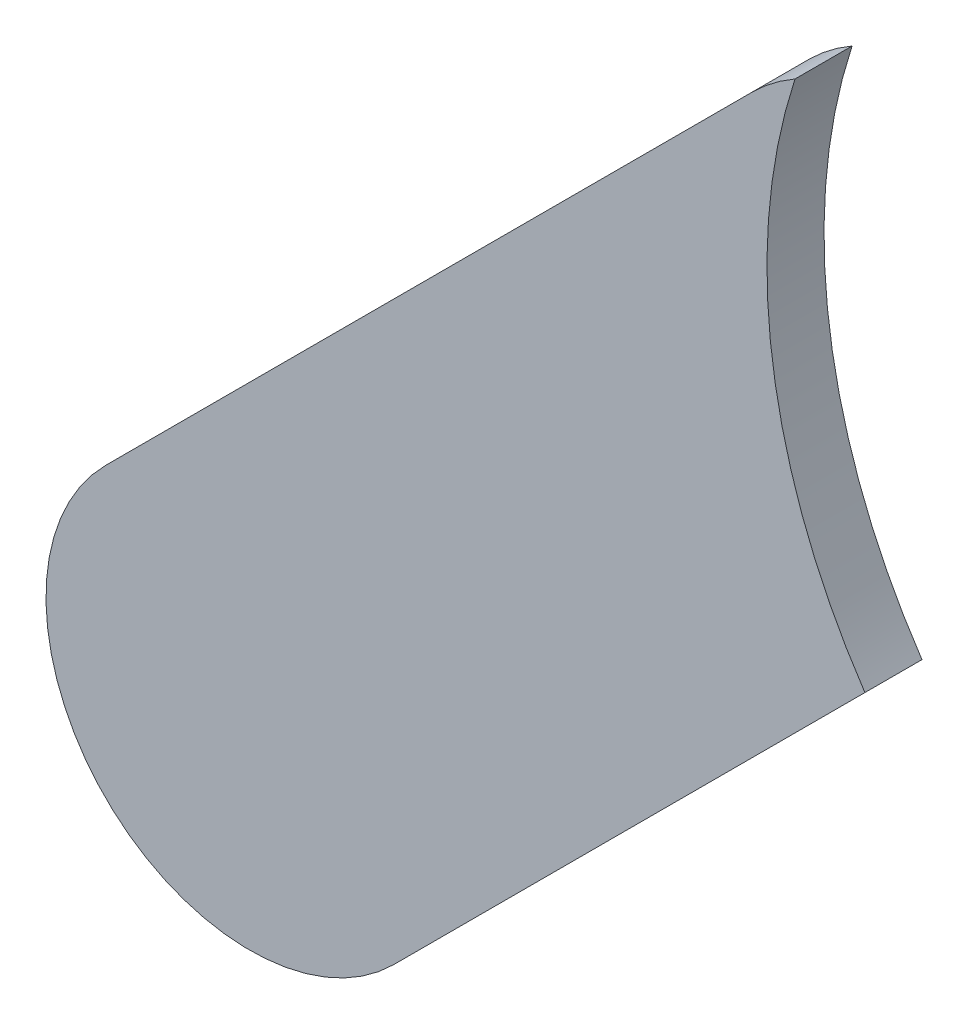
ISO-10303-21;
HEADER;
FILE_DESCRIPTION(('STEP AP214'),'2;1');
FILE_NAME('part.step','',(''),(''),'','','');
FILE_SCHEMA(('AUTOMOTIVE_DESIGN { 1 0 10303 214 1 1 1 1 }'));
ENDSEC;
DATA;
#1=APPLICATION_CONTEXT('core data for automotive mechanical design processes');
#2=APPLICATION_PROTOCOL_DEFINITION('international standard','automotive_design',2000,#1);
#3=PRODUCT_CONTEXT('',#1,'mechanical');
#4=PRODUCT('Part','Part','',(#3));
#5=PRODUCT_RELATED_PRODUCT_CATEGORY('part','',(#4));
#6=PRODUCT_DEFINITION_FORMATION('','',#4);
#7=PRODUCT_DEFINITION_CONTEXT('part definition',#1,'design');
#8=PRODUCT_DEFINITION('design','',#6,#7);
#9=PRODUCT_DEFINITION_SHAPE('','',#8);
#10=(LENGTH_UNIT() NAMED_UNIT(*) SI_UNIT(.MILLI.,.METRE.));
#11=(NAMED_UNIT(*) PLANE_ANGLE_UNIT() SI_UNIT($,.RADIAN.));
#12=(NAMED_UNIT(*) SI_UNIT($,.STERADIAN.) SOLID_ANGLE_UNIT());
#13=UNCERTAINTY_MEASURE_WITH_UNIT(LENGTH_MEASURE(1.E-05),#10,'distance_accuracy_value','');
#14=(GEOMETRIC_REPRESENTATION_CONTEXT(3) GLOBAL_UNCERTAINTY_ASSIGNED_CONTEXT((#13)) GLOBAL_UNIT_ASSIGNED_CONTEXT((#10,
#11,#12)) REPRESENTATION_CONTEXT('',''));
#15=CARTESIAN_POINT('',(0.,0.,0.));
#16=DIRECTION('',(0.,0.,1.));
#17=DIRECTION('',(1.,0.,0.));
#18=AXIS2_PLACEMENT_3D('',#15,#16,#17);
#19=CARTESIAN_POINT('',(92.22889606,102.1942203,0.));
#20=DIRECTION('',(-0.707106781186548,0.707106781186548,0.));
#21=DIRECTION('',(0.707106781186548,0.707106781186548,0.));
#22=AXIS2_PLACEMENT_3D('',#19,#20,#21);
#23=PLANE('',#22);
#24=DIRECTION('',(0.707106781186548,0.707106781186548,0.));
#25=VECTOR('',#24,1.);
#26=CARTESIAN_POINT('',(92.22889606,102.1942203,0.03556));
#27=LINE('',#26,#25);
#28=CARTESIAN_POINT('',(92.22889606,102.1942203,0.03556));
#29=VERTEX_POINT('',#28);
#30=CARTESIAN_POINT('',(92.522421570459,102.487745810459,0.03556));
#31=VERTEX_POINT('',#30);
#32=EDGE_CURVE('E11',#29,#31,#27,.T.);
#33=ORIENTED_EDGE('',*,*,#32,.F.);
#34=DIRECTION('',(0.,0.,1.));
#35=VECTOR('',#34,1.);
#36=CARTESIAN_POINT('',(92.22889606,102.1942203,0.));
#37=LINE('',#36,#35);
#38=CARTESIAN_POINT('',(92.22889606,102.1942203,0.));
#39=VERTEX_POINT('',#38);
#40=EDGE_CURVE('E24',#39,#29,#37,.T.);
#41=ORIENTED_EDGE('',*,*,#40,.F.);
#42=DIRECTION('',(0.707106781186548,0.707106781186548,0.));
#43=VECTOR('',#42,1.);
#44=CARTESIAN_POINT('',(92.22889606,102.1942203,0.));
#45=LINE('',#44,#43);
#46=CARTESIAN_POINT('',(92.522421570459,102.487745810459,0.));
#47=VERTEX_POINT('',#46);
#48=EDGE_CURVE('E82',#39,#47,#45,.T.);
#49=ORIENTED_EDGE('',*,*,#48,.T.);
#50=DIRECTION('',(0.,0.,1.));
#51=VECTOR('',#50,1.);
#52=CARTESIAN_POINT('',(92.522421570459,102.487745810459,0.));
#53=LINE('',#52,#51);
#54=EDGE_CURVE('E37',#47,#31,#53,.T.);
#55=ORIENTED_EDGE('',*,*,#54,.T.);
#56=EDGE_LOOP('',(#33,#41,#49,#55));
#57=FACE_BOUND('',#56,.T.);
#58=ADVANCED_FACE('F17',(#57),#23,.F.);
#59=CARTESIAN_POINT('',(92.8169721,102.68697268,0.));
#60=DIRECTION('',(0.,0.,-1.));
#61=DIRECTION('',(1.,0.,0.));
#62=AXIS2_PLACEMENT_3D('',#59,#60,#61);
#63=CYLINDRICAL_SURFACE('',#62,0.3556);
#64=DIRECTION('',(0.,0.,1.));
#65=VECTOR('',#64,1.);
#66=CARTESIAN_POINT('',(92.4788686814524,102.797142722963,0.));
#67=LINE('',#66,#65);
#68=CARTESIAN_POINT('',(92.4788686814524,102.797142722963,0.));
#69=VERTEX_POINT('',#68);
#70=CARTESIAN_POINT('',(92.4788686814524,102.797142722963,0.03556));
#71=VERTEX_POINT('',#70);
#72=EDGE_CURVE('E98',#69,#71,#67,.T.);
#73=ORIENTED_EDGE('',*,*,#72,.T.);
#74=CARTESIAN_POINT('',(92.8169721,102.68697268,0.03556));
#75=DIRECTION('',(0.,0.,1.));
#76=DIRECTION('',(1.,0.,0.));
#77=AXIS2_PLACEMENT_3D('',#74,#75,#76);
#78=CIRCLE('',#77,0.3556);
#79=EDGE_CURVE('E95',#71,#31,#78,.T.);
#80=ORIENTED_EDGE('',*,*,#79,.T.);
#81=ORIENTED_EDGE('',*,*,#54,.F.);
#82=CARTESIAN_POINT('',(92.8169721,102.68697268,0.));
#83=DIRECTION('',(0.,0.,1.));
#84=DIRECTION('',(1.,0.,0.));
#85=AXIS2_PLACEMENT_3D('',#82,#83,#84);
#86=CIRCLE('',#85,0.3556);
#87=EDGE_CURVE('E93',#69,#47,#86,.T.);
#88=ORIENTED_EDGE('',*,*,#87,.F.);
#89=EDGE_LOOP('',(#73,#80,#81,#88));
#90=FACE_BOUND('',#89,.T.);
#91=ADVANCED_FACE('F103',(#90),#63,.F.);
#92=CARTESIAN_POINT('',(92.54204504,102.68697268,0.));
#93=DIRECTION('',(0.,0.,-1.));
#94=DIRECTION('',(0.707106781186548,-0.707106781186548,0.));
#95=AXIS2_PLACEMENT_3D('',#92,#93,#94);
#96=CYLINDRICAL_SURFACE('',#95,0.126998782064157);
#97=CARTESIAN_POINT('',(92.54204504,102.68697268,0.03556));
#98=DIRECTION('',(0.,0.,1.));
#99=DIRECTION('',(0.707106781186548,-0.707106781186548,0.));
#100=AXIS2_PLACEMENT_3D('',#97,#98,#99);
#101=CIRCLE('',#100,0.126998782064157);
#102=CARTESIAN_POINT('',(92.45224334,102.77677438,0.03556));
#103=VERTEX_POINT('',#102);
#104=EDGE_CURVE('E90',#71,#103,#101,.T.);
#105=ORIENTED_EDGE('',*,*,#104,.F.);
#106=ORIENTED_EDGE('',*,*,#72,.F.);
#107=CARTESIAN_POINT('',(92.54204504,102.68697268,0.));
#108=DIRECTION('',(0.,0.,1.));
#109=DIRECTION('',(0.707106781186548,-0.707106781186548,0.));
#110=AXIS2_PLACEMENT_3D('',#107,#108,#109);
#111=CIRCLE('',#110,0.126998782064157);
#112=CARTESIAN_POINT('',(92.45224334,102.77677438,0.));
#113=VERTEX_POINT('',#112);
#114=EDGE_CURVE('E88',#69,#113,#111,.T.);
#115=ORIENTED_EDGE('',*,*,#114,.T.);
#116=DIRECTION('',(0.,0.,1.));
#117=VECTOR('',#116,1.);
#118=CARTESIAN_POINT('',(92.45224334,102.77677438,0.));
#119=LINE('',#118,#117);
#120=EDGE_CURVE('E73',#113,#103,#119,.T.);
#121=ORIENTED_EDGE('',*,*,#120,.T.);
#122=EDGE_LOOP('',(#105,#106,#115,#121));
#123=FACE_BOUND('',#122,.T.);
#124=ADVANCED_FACE('F109',(#123),#96,.T.);
#125=CARTESIAN_POINT('',(92.45224334,102.77677438,0.));
#126=DIRECTION('',(0.707106781186548,-0.707106781186548,0.));
#127=DIRECTION('',(-0.707106781186548,-0.707106781186548,0.));
#128=AXIS2_PLACEMENT_3D('',#125,#126,#127);
#129=PLANE('',#128);
#130=DIRECTION('',(-0.707106781186548,-0.707106781186548,0.));
#131=VECTOR('',#130,1.);
#132=CARTESIAN_POINT('',(92.45224334,102.77677438,0.03556));
#133=LINE('',#132,#131);
#134=CARTESIAN_POINT('',(92.04929266,102.3738237,0.03556));
#135=VERTEX_POINT('',#134);
#136=EDGE_CURVE('E77',#103,#135,#133,.T.);
#137=ORIENTED_EDGE('',*,*,#136,.F.);
#138=ORIENTED_EDGE('',*,*,#120,.F.);
#139=DIRECTION('',(-0.707106781186548,-0.707106781186548,0.));
#140=VECTOR('',#139,1.);
#141=CARTESIAN_POINT('',(92.45224334,102.77677438,0.));
#142=LINE('',#141,#140);
#143=CARTESIAN_POINT('',(92.04929266,102.3738237,0.));
#144=VERTEX_POINT('',#143);
#145=EDGE_CURVE('E69',#113,#144,#142,.T.);
#146=ORIENTED_EDGE('',*,*,#145,.T.);
#147=DIRECTION('',(0.,0.,1.));
#148=VECTOR('',#147,1.);
#149=CARTESIAN_POINT('',(92.04929266,102.3738237,0.));
#150=LINE('',#149,#148);
#151=EDGE_CURVE('E59',#144,#135,#150,.T.);
#152=ORIENTED_EDGE('',*,*,#151,.T.);
#153=EDGE_LOOP('',(#137,#138,#146,#152));
#154=FACE_BOUND('',#153,.T.);
#155=ADVANCED_FACE('F72',(#154),#129,.F.);
#156=CARTESIAN_POINT('',(92.13909436,102.284022,0.));
#157=DIRECTION('',(0.,0.,-1.));
#158=DIRECTION('',(-0.707106781186492,0.707106781186604,0.));
#159=AXIS2_PLACEMENT_3D('',#156,#157,#158);
#160=CYLINDRICAL_SURFACE('',#159,0.126998782064157);
#161=CARTESIAN_POINT('',(92.13909436,102.284022,0.03556));
#162=DIRECTION('',(0.,0.,1.));
#163=DIRECTION('',(-0.707106781186492,0.707106781186604,0.));
#164=AXIS2_PLACEMENT_3D('',#161,#162,#163);
#165=CIRCLE('',#164,0.126998782064157);
#166=EDGE_CURVE('E65',#135,#29,#165,.T.);
#167=ORIENTED_EDGE('',*,*,#166,.F.);
#168=ORIENTED_EDGE('',*,*,#151,.F.);
#169=CARTESIAN_POINT('',(92.13909436,102.284022,0.));
#170=DIRECTION('',(0.,0.,1.));
#171=DIRECTION('',(-0.707106781186492,0.707106781186604,0.));
#172=AXIS2_PLACEMENT_3D('',#169,#170,#171);
#173=CIRCLE('',#172,0.126998782064157);
#174=EDGE_CURVE('E63',#144,#39,#173,.T.);
#175=ORIENTED_EDGE('',*,*,#174,.T.);
#176=ORIENTED_EDGE('',*,*,#40,.T.);
#177=EDGE_LOOP('',(#167,#168,#175,#176));
#178=FACE_BOUND('',#177,.T.);
#179=ADVANCED_FACE('F61',(#178),#160,.T.);
#180=CARTESIAN_POINT('',(92.22889606,102.1942203,0.));
#181=DIRECTION('',(0.,0.,-1.));
#182=DIRECTION('',(-1.,0.,0.));
#183=AXIS2_PLACEMENT_3D('',#180,#181,#182);
#184=PLANE('',#183);
#185=ORIENTED_EDGE('',*,*,#48,.F.);
#186=ORIENTED_EDGE('',*,*,#174,.F.);
#187=ORIENTED_EDGE('',*,*,#145,.F.);
#188=ORIENTED_EDGE('',*,*,#114,.F.);
#189=ORIENTED_EDGE('',*,*,#87,.T.);
#190=EDGE_LOOP('',(#185,#186,#187,#188,#189));
#191=FACE_BOUND('',#190,.T.);
#192=ADVANCED_FACE('F80',(#191),#184,.T.);
#193=CARTESIAN_POINT('',(92.22889606,102.1942203,0.03556));
#194=DIRECTION('',(0.,0.,-1.));
#195=DIRECTION('',(-1.,0.,0.));
#196=AXIS2_PLACEMENT_3D('',#193,#194,#195);
#197=PLANE('',#196);
#198=ORIENTED_EDGE('',*,*,#166,.T.);
#199=ORIENTED_EDGE('',*,*,#32,.T.);
#200=ORIENTED_EDGE('',*,*,#79,.F.);
#201=ORIENTED_EDGE('',*,*,#104,.T.);
#202=ORIENTED_EDGE('',*,*,#136,.T.);
#203=EDGE_LOOP('',(#198,#199,#200,#201,#202));
#204=FACE_BOUND('',#203,.T.);
#205=ADVANCED_FACE('F107',(#204),#197,.F.);
#206=CLOSED_SHELL('',(#58,#91,#124,#155,#179,#192,#205));
#207=MANIFOLD_SOLID_BREP('B1',#206);
#208=ADVANCED_BREP_SHAPE_REPRESENTATION('',(#18,#207),#14);
#209=SHAPE_DEFINITION_REPRESENTATION(#9,#208);
ENDSEC;
END-ISO-10303-21;
